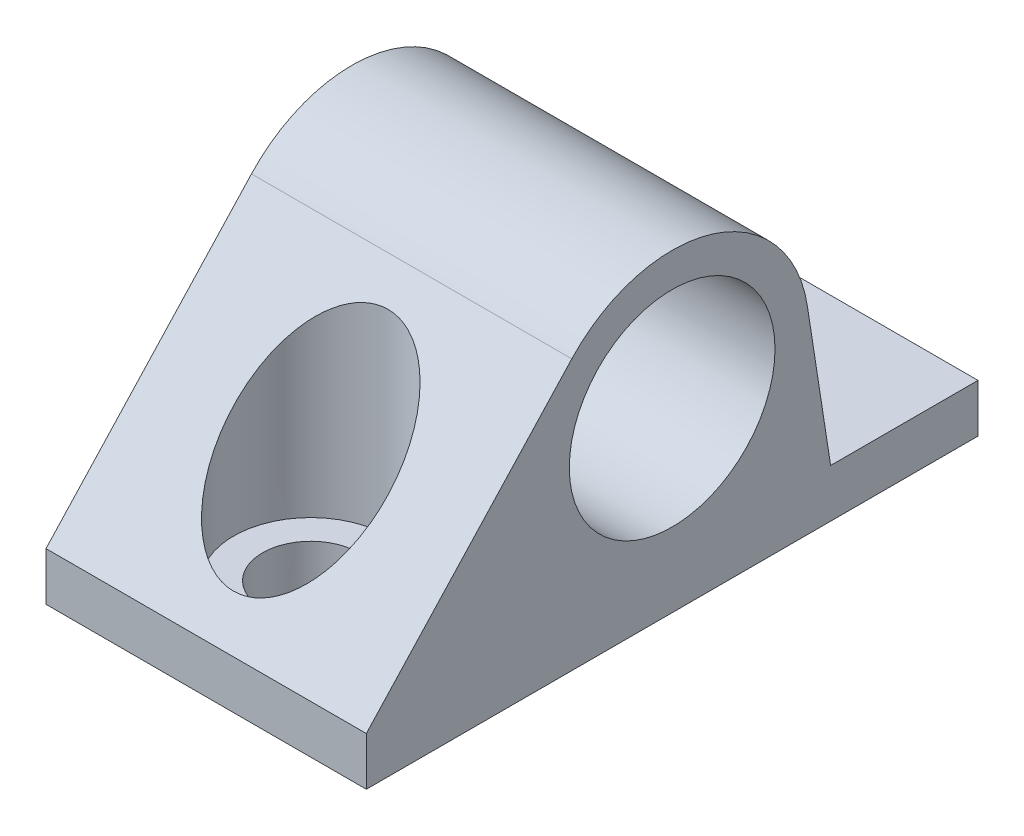
ISO-10303-21;
HEADER;
FILE_DESCRIPTION(('STEP AP214'),'2;1');
FILE_NAME('part.step','',(''),(''),'','','');
FILE_SCHEMA(('AUTOMOTIVE_DESIGN { 1 0 10303 214 1 1 1 1 }'));
ENDSEC;
DATA;
#1=APPLICATION_CONTEXT('core data for automotive mechanical design processes');
#2=APPLICATION_PROTOCOL_DEFINITION('international standard','automotive_design',2000,#1);
#3=PRODUCT_CONTEXT('',#1,'mechanical');
#4=PRODUCT('Part','Part','',(#3));
#5=PRODUCT_RELATED_PRODUCT_CATEGORY('part','',(#4));
#6=PRODUCT_DEFINITION_FORMATION('','',#4);
#7=PRODUCT_DEFINITION_CONTEXT('part definition',#1,'design');
#8=PRODUCT_DEFINITION('design','',#6,#7);
#9=PRODUCT_DEFINITION_SHAPE('','',#8);
#10=(LENGTH_UNIT() NAMED_UNIT(*) SI_UNIT(.MILLI.,.METRE.));
#11=(NAMED_UNIT(*) PLANE_ANGLE_UNIT() SI_UNIT($,.RADIAN.));
#12=(NAMED_UNIT(*) SI_UNIT($,.STERADIAN.) SOLID_ANGLE_UNIT());
#13=UNCERTAINTY_MEASURE_WITH_UNIT(LENGTH_MEASURE(1.E-05),#10,'distance_accuracy_value','');
#14=(GEOMETRIC_REPRESENTATION_CONTEXT(3) GLOBAL_UNCERTAINTY_ASSIGNED_CONTEXT((#13)) GLOBAL_UNIT_ASSIGNED_CONTEXT((#10,
#11,#12)) REPRESENTATION_CONTEXT('',''));
#15=CARTESIAN_POINT('',(0.,0.,0.));
#16=DIRECTION('',(0.,0.,1.));
#17=DIRECTION('',(1.,0.,0.));
#18=AXIS2_PLACEMENT_3D('',#15,#16,#17);
#19=CARTESIAN_POINT('',(121.506176910239,198.484265544604,-28.8439743525757));
#20=DIRECTION('',(0.,0.153427582169929,-0.988159894465207));
#21=DIRECTION('',(0.,0.988159894465207,0.153427582169929));
#22=AXIS2_PLACEMENT_3D('',#19,#20,#21);
#23=PLANE('',#22);
#24=CARTESIAN_POINT('',(111.556176910239,181.377967013817,-31.5));
#25=DIRECTION('',(0.,0.153427582169929,-0.988159894465207));
#26=DIRECTION('',(0.,-0.988159894465207,-0.153427582169929));
#27=AXIS2_PLACEMENT_3D('',#24,#25,#26);
#28=ELLIPSE('',#27,31.2851179176099,4.8);
#29=CARTESIAN_POINT('',(107.55798634947,198.484265544604,-28.8439743525757));
#30=VERTEX_POINT('',#29);
#31=CARTESIAN_POINT('',(109.06123317671,207.788399993048,-27.3993591029543));
#32=VERTEX_POINT('',#31);
#33=EDGE_CURVE('E60',#30,#32,#28,.T.);
#34=ORIENTED_EDGE('',*,*,#33,.F.);
#35=DIRECTION('',(-1.,0.,0.));
#36=VECTOR('',#35,1.);
#37=CARTESIAN_POINT('',(121.506176910239,198.484265544604,-28.8439743525757));
#38=LINE('',#37,#36);
#39=CARTESIAN_POINT('',(101.606176910238,198.484265544604,-28.8439743525757));
#40=VERTEX_POINT('',#39);
#41=EDGE_CURVE('E142',#30,#40,#38,.T.);
#42=ORIENTED_EDGE('',*,*,#41,.T.);
#43=DIRECTION('',(0.,-0.988159894465207,-0.153427582169929));
#44=VECTOR('',#43,1.);
#45=CARTESIAN_POINT('',(101.606176910238,198.484265544604,-28.8439743525757));
#46=LINE('',#45,#44);
#47=CARTESIAN_POINT('',(101.606176910238,207.788399993048,-27.3993591029543));
#48=VERTEX_POINT('',#47);
#49=EDGE_CURVE('E166',#48,#40,#46,.T.);
#50=ORIENTED_EDGE('',*,*,#49,.F.);
#51=DIRECTION('',(-1.,0.,0.));
#52=VECTOR('',#51,1.);
#53=CARTESIAN_POINT('',(121.506176910239,207.788399993048,-27.3993591029543));
#54=LINE('',#53,#52);
#55=EDGE_CURVE('E239',#32,#48,#54,.T.);
#56=ORIENTED_EDGE('',*,*,#55,.F.);
#57=EDGE_LOOP('',(#34,#42,#50,#56));
#58=FACE_BOUND('',#57,.T.);
#59=ADVANCED_FACE('F40',(#58),#23,.T.);
#60=CARTESIAN_POINT('',(101.606176910239,198.484265544604,-38.));
#61=DIRECTION('',(-1.,0.,0.));
#62=DIRECTION('',(0.,-1.,0.));
#63=AXIS2_PLACEMENT_3D('',#60,#61,#62);
#64=PLANE('',#63);
#65=DIRECTION('',(0.,-1.,0.));
#66=VECTOR('',#65,1.);
#67=CARTESIAN_POINT('',(101.606176910239,198.484265544604,0.));
#68=LINE('',#67,#66);
#69=CARTESIAN_POINT('',(101.606176910239,198.484265544604,0.));
#70=VERTEX_POINT('',#69);
#71=CARTESIAN_POINT('',(101.606176910239,195.484265544604,0.));
#72=VERTEX_POINT('',#71);
#73=EDGE_CURVE('E150',#70,#72,#68,.T.);
#74=ORIENTED_EDGE('',*,*,#73,.F.);
#75=DIRECTION('',(0.,0.733536752395156,-0.679649786938514));
#76=VECTOR('',#75,1.);
#77=CARTESIAN_POINT('',(101.606176910238,212.261288733581,-12.7649376046412));
#78=LINE('',#77,#76);
#79=CARTESIAN_POINT('',(101.606176910238,212.261288733581,-12.7649376046412));
#80=VERTEX_POINT('',#79);
#81=EDGE_CURVE('E212',#70,#80,#78,.T.);
#82=ORIENTED_EDGE('',*,*,#81,.T.);
#83=CARTESIAN_POINT('',(101.606176910238,206.484265544604,-19.));
#84=DIRECTION('',(-1.,0.,0.));
#85=DIRECTION('',(0.,0.,-1.));
#86=AXIS2_PLACEMENT_3D('',#83,#84,#85);
#87=CIRCLE('',#86,8.50000000000001);
#88=EDGE_CURVE('E171',#80,#48,#87,.T.);
#89=ORIENTED_EDGE('',*,*,#88,.T.);
#90=ORIENTED_EDGE('',*,*,#49,.T.);
#91=DIRECTION('',(0.,0.,1.));
#92=VECTOR('',#91,1.);
#93=CARTESIAN_POINT('',(101.606176910239,198.484265544604,-38.));
#94=LINE('',#93,#92);
#95=CARTESIAN_POINT('',(101.606176910239,198.484265544604,-38.));
#96=VERTEX_POINT('',#95);
#97=EDGE_CURVE('E50',#96,#40,#94,.T.);
#98=ORIENTED_EDGE('',*,*,#97,.F.);
#99=DIRECTION('',(0.,-1.,0.));
#100=VECTOR('',#99,1.);
#101=CARTESIAN_POINT('',(101.606176910239,198.484265544604,-38.));
#102=LINE('',#101,#100);
#103=CARTESIAN_POINT('',(101.606176910239,195.484265544604,-38.));
#104=VERTEX_POINT('',#103);
#105=EDGE_CURVE('E262',#96,#104,#102,.T.);
#106=ORIENTED_EDGE('',*,*,#105,.T.);
#107=DIRECTION('',(0.,0.,1.));
#108=VECTOR('',#107,1.);
#109=CARTESIAN_POINT('',(101.606176910239,195.484265544604,-38.));
#110=LINE('',#109,#108);
#111=EDGE_CURVE('E251',#104,#72,#110,.T.);
#112=ORIENTED_EDGE('',*,*,#111,.T.);
#113=EDGE_LOOP('',(#74,#82,#89,#90,#98,#106,#112));
#114=FACE_BOUND('',#113,.T.);
#115=CARTESIAN_POINT('',(101.606176910238,206.484265544604,-19.));
#116=DIRECTION('',(-1.,0.,0.));
#117=DIRECTION('',(0.,0.,1.));
#118=AXIS2_PLACEMENT_3D('',#115,#116,#117);
#119=CIRCLE('',#118,6.39);
#120=CARTESIAN_POINT('',(101.606176910238,206.484265544604,-12.61));
#121=VERTEX_POINT('',#120);
#122=EDGE_CURVE('E207',#121,#121,#119,.T.);
#123=ORIENTED_EDGE('',*,*,#122,.F.);
#124=EDGE_LOOP('',(#123));
#125=FACE_BOUND('',#124,.T.);
#126=ADVANCED_FACE('F42',(#114,#125),#64,.T.);
#127=CARTESIAN_POINT('',(121.506176910239,198.484265544604,-38.));
#128=DIRECTION('',(0.,1.,0.));
#129=DIRECTION('',(-1.,0.,0.));
#130=AXIS2_PLACEMENT_3D('',#127,#128,#129);
#131=PLANE('',#130);
#132=ORIENTED_EDGE('',*,*,#41,.F.);
#133=CARTESIAN_POINT('',(111.556176910239,198.484265544604,-31.5));
#134=DIRECTION('',(0.,-1.,0.));
#135=DIRECTION('',(1.,0.,0.));
#136=AXIS2_PLACEMENT_3D('',#133,#134,#135);
#137=CIRCLE('',#136,4.8);
#138=CARTESIAN_POINT('',(115.554367471008,198.484265544604,-28.8439743525757));
#139=VERTEX_POINT('',#138);
#140=EDGE_CURVE('E132',#139,#30,#137,.T.);
#141=ORIENTED_EDGE('',*,*,#140,.F.);
#142=CARTESIAN_POINT('',(121.506176910239,198.484265544604,-28.8439743525757));
#143=VERTEX_POINT('',#142);
#144=EDGE_CURVE('E70',#143,#139,#38,.T.);
#145=ORIENTED_EDGE('',*,*,#144,.F.);
#146=DIRECTION('',(0.,0.,1.));
#147=VECTOR('',#146,1.);
#148=CARTESIAN_POINT('',(121.506176910239,198.484265544604,-38.));
#149=LINE('',#148,#147);
#150=CARTESIAN_POINT('',(121.506176910239,198.484265544604,-38.));
#151=VERTEX_POINT('',#150);
#152=EDGE_CURVE('E244',#151,#143,#149,.T.);
#153=ORIENTED_EDGE('',*,*,#152,.F.);
#154=DIRECTION('',(-1.,0.,0.));
#155=VECTOR('',#154,1.);
#156=CARTESIAN_POINT('',(121.506176910239,198.484265544604,-38.));
#157=LINE('',#156,#155);
#158=EDGE_CURVE('E242',#151,#96,#157,.T.);
#159=ORIENTED_EDGE('',*,*,#158,.T.);
#160=ORIENTED_EDGE('',*,*,#97,.T.);
#161=EDGE_LOOP('',(#132,#141,#145,#153,#159,#160));
#162=FACE_BOUND('',#161,.T.);
#163=CARTESIAN_POINT('',(111.556176910239,198.484265544604,-31.5));
#164=DIRECTION('',(0.,-1.,0.));
#165=DIRECTION('',(1.,0.,0.));
#166=AXIS2_PLACEMENT_3D('',#163,#164,#165);
#167=CIRCLE('',#166,3.);
#168=CARTESIAN_POINT('',(114.556176910239,198.484265544604,-31.5));
#169=VERTEX_POINT('',#168);
#170=EDGE_CURVE('E136',#169,#169,#167,.T.);
#171=ORIENTED_EDGE('',*,*,#170,.T.);
#172=EDGE_LOOP('',(#171));
#173=FACE_BOUND('',#172,.T.);
#174=ADVANCED_FACE('F139',(#162,#173),#131,.T.);
#175=CARTESIAN_POINT('',(121.506176910239,195.484265544604,-38.));
#176=DIRECTION('',(1.,0.,0.));
#177=DIRECTION('',(0.,0.,-1.));
#178=AXIS2_PLACEMENT_3D('',#175,#176,#177);
#179=PLANE('',#178);
#180=DIRECTION('',(0.,1.,0.));
#181=VECTOR('',#180,1.);
#182=CARTESIAN_POINT('',(121.506176910239,195.484265544604,0.));
#183=LINE('',#182,#181);
#184=CARTESIAN_POINT('',(121.506176910239,195.484265544604,0.));
#185=VERTEX_POINT('',#184);
#186=CARTESIAN_POINT('',(121.506176910239,198.484265544604,0.));
#187=VERTEX_POINT('',#186);
#188=EDGE_CURVE('E263',#185,#187,#183,.T.);
#189=ORIENTED_EDGE('',*,*,#188,.F.);
#190=DIRECTION('',(0.,0.,1.));
#191=VECTOR('',#190,1.);
#192=CARTESIAN_POINT('',(121.506176910239,195.484265544604,-38.));
#193=LINE('',#192,#191);
#194=CARTESIAN_POINT('',(121.506176910239,195.484265544604,-38.));
#195=VERTEX_POINT('',#194);
#196=EDGE_CURVE('E247',#195,#185,#193,.T.);
#197=ORIENTED_EDGE('',*,*,#196,.F.);
#198=DIRECTION('',(0.,1.,0.));
#199=VECTOR('',#198,1.);
#200=CARTESIAN_POINT('',(121.506176910239,195.484265544604,-38.));
#201=LINE('',#200,#199);
#202=EDGE_CURVE('E270',#195,#151,#201,.T.);
#203=ORIENTED_EDGE('',*,*,#202,.T.);
#204=ORIENTED_EDGE('',*,*,#152,.T.);
#205=DIRECTION('',(0.,-0.988159894465207,-0.153427582169929));
#206=VECTOR('',#205,1.);
#207=CARTESIAN_POINT('',(121.506176910239,198.484265544604,-28.8439743525757));
#208=LINE('',#207,#206);
#209=CARTESIAN_POINT('',(121.506176910239,207.788399993048,-27.3993591029543));
#210=VERTEX_POINT('',#209);
#211=EDGE_CURVE('E148',#210,#143,#208,.T.);
#212=ORIENTED_EDGE('',*,*,#211,.F.);
#213=CARTESIAN_POINT('',(121.506176910239,206.484265544604,-19.));
#214=DIRECTION('',(-1.,0.,0.));
#215=DIRECTION('',(0.,0.,-1.));
#216=AXIS2_PLACEMENT_3D('',#213,#214,#215);
#217=CIRCLE('',#216,8.50000000000001);
#218=CARTESIAN_POINT('',(121.506176910239,212.261288733581,-12.7649376046412));
#219=VERTEX_POINT('',#218);
#220=EDGE_CURVE('E220',#219,#210,#217,.T.);
#221=ORIENTED_EDGE('',*,*,#220,.F.);
#222=DIRECTION('',(0.,0.733536752395156,-0.679649786938514));
#223=VECTOR('',#222,1.);
#224=CARTESIAN_POINT('',(121.506176910239,212.261288733581,-12.7649376046412));
#225=LINE('',#224,#223);
#226=EDGE_CURVE('E216',#187,#219,#225,.T.);
#227=ORIENTED_EDGE('',*,*,#226,.F.);
#228=EDGE_LOOP('',(#189,#197,#203,#204,#212,#221,#227));
#229=FACE_BOUND('',#228,.T.);
#230=CARTESIAN_POINT('',(121.506176910239,206.484265544604,-19.));
#231=DIRECTION('',(-1.,0.,0.));
#232=DIRECTION('',(0.,0.,1.));
#233=AXIS2_PLACEMENT_3D('',#230,#231,#232);
#234=CIRCLE('',#233,6.39);
#235=CARTESIAN_POINT('',(121.506176910239,206.484265544604,-12.61));
#236=VERTEX_POINT('',#235);
#237=EDGE_CURVE('E208',#236,#236,#234,.T.);
#238=ORIENTED_EDGE('',*,*,#237,.T.);
#239=EDGE_LOOP('',(#238));
#240=FACE_BOUND('',#239,.T.);
#241=ADVANCED_FACE('F288',(#229,#240),#179,.T.);
#242=CARTESIAN_POINT('',(114.604851947764,195.484265544604,-38.));
#243=DIRECTION('',(0.,-1.,0.));
#244=DIRECTION('',(0.,0.,-1.));
#245=AXIS2_PLACEMENT_3D('',#242,#243,#244);
#246=PLANE('',#245);
#247=CARTESIAN_POINT('',(111.556176910239,195.484265544604,-6.5));
#248=DIRECTION('',(0.,-1.,0.));
#249=DIRECTION('',(0.,0.,-1.));
#250=AXIS2_PLACEMENT_3D('',#247,#248,#249);
#251=CIRCLE('',#250,3.);
#252=CARTESIAN_POINT('',(111.556176910239,195.484265544604,-9.5));
#253=VERTEX_POINT('',#252);
#254=EDGE_CURVE('E44',#253,#253,#251,.T.);
#255=ORIENTED_EDGE('',*,*,#254,.F.);
#256=EDGE_LOOP('',(#255));
#257=FACE_BOUND('',#256,.T.);
#258=CARTESIAN_POINT('',(111.556176910239,195.484265544604,-31.5));
#259=DIRECTION('',(0.,-1.,0.));
#260=DIRECTION('',(0.,0.,-1.));
#261=AXIS2_PLACEMENT_3D('',#258,#259,#260);
#262=CIRCLE('',#261,3.);
#263=CARTESIAN_POINT('',(111.556176910239,195.484265544604,-34.5));
#264=VERTEX_POINT('',#263);
#265=EDGE_CURVE('E203',#264,#264,#262,.T.);
#266=ORIENTED_EDGE('',*,*,#265,.F.);
#267=EDGE_LOOP('',(#266));
#268=FACE_BOUND('',#267,.T.);
#269=DIRECTION('',(1.,0.,0.));
#270=VECTOR('',#269,1.);
#271=CARTESIAN_POINT('',(114.604851947764,195.484265544604,0.));
#272=LINE('',#271,#270);
#273=EDGE_CURVE('E156',#72,#185,#272,.T.);
#274=ORIENTED_EDGE('',*,*,#273,.F.);
#275=ORIENTED_EDGE('',*,*,#111,.F.);
#276=DIRECTION('',(1.,0.,0.));
#277=VECTOR('',#276,1.);
#278=CARTESIAN_POINT('',(101.606176910239,195.484265544604,-38.));
#279=LINE('',#278,#277);
#280=EDGE_CURVE('E272',#104,#195,#279,.T.);
#281=ORIENTED_EDGE('',*,*,#280,.T.);
#282=ORIENTED_EDGE('',*,*,#196,.T.);
#283=EDGE_LOOP('',(#274,#275,#281,#282));
#284=FACE_BOUND('',#283,.T.);
#285=ADVANCED_FACE('F292',(#257,#268,#284),#246,.T.);
#286=CARTESIAN_POINT('',(101.606176910239,195.484265544604,-38.));
#287=DIRECTION('',(0.,0.,1.));
#288=DIRECTION('',(1.,0.,0.));
#289=AXIS2_PLACEMENT_3D('',#286,#287,#288);
#290=PLANE('',#289);
#291=ORIENTED_EDGE('',*,*,#105,.F.);
#292=ORIENTED_EDGE('',*,*,#158,.F.);
#293=ORIENTED_EDGE('',*,*,#202,.F.);
#294=ORIENTED_EDGE('',*,*,#280,.F.);
#295=EDGE_LOOP('',(#291,#292,#293,#294));
#296=FACE_BOUND('',#295,.T.);
#297=ADVANCED_FACE('F318',(#296),#290,.F.);
#298=CARTESIAN_POINT('',(101.606176910239,195.484265544604,0.));
#299=DIRECTION('',(0.,0.,1.));
#300=DIRECTION('',(1.,0.,0.));
#301=AXIS2_PLACEMENT_3D('',#298,#299,#300);
#302=PLANE('',#301);
#303=ORIENTED_EDGE('',*,*,#73,.T.);
#304=ORIENTED_EDGE('',*,*,#273,.T.);
#305=ORIENTED_EDGE('',*,*,#188,.T.);
#306=DIRECTION('',(-1.,0.,0.));
#307=VECTOR('',#306,1.);
#308=CARTESIAN_POINT('',(121.506176910239,198.484265544604,0.));
#309=LINE('',#308,#307);
#310=EDGE_CURVE('E258',#187,#70,#309,.T.);
#311=ORIENTED_EDGE('',*,*,#310,.T.);
#312=EDGE_LOOP('',(#303,#304,#305,#311));
#313=FACE_BOUND('',#312,.T.);
#314=ADVANCED_FACE('F313',(#313),#302,.T.);
#315=CARTESIAN_POINT('',(114.051120643768,207.788399993048,-27.3993591029543));
#316=VERTEX_POINT('',#315);
#317=EDGE_CURVE('E130',#316,#139,#28,.T.);
#318=ORIENTED_EDGE('',*,*,#317,.F.);
#319=EDGE_CURVE('E159',#210,#316,#54,.T.);
#320=ORIENTED_EDGE('',*,*,#319,.F.);
#321=ORIENTED_EDGE('',*,*,#211,.T.);
#322=ORIENTED_EDGE('',*,*,#144,.T.);
#323=EDGE_LOOP('',(#318,#320,#321,#322));
#324=FACE_BOUND('',#323,.T.);
#325=ADVANCED_FACE('F146',(#324),#23,.T.);
#326=CARTESIAN_POINT('',(121.506176910239,206.484265544604,-19.));
#327=DIRECTION('',(-1.,0.,0.));
#328=DIRECTION('',(0.,0.,1.));
#329=AXIS2_PLACEMENT_3D('',#326,#327,#328);
#330=CYLINDRICAL_SURFACE('',#329,8.50000000000001);
#331=CARTESIAN_POINT('',(109.06123317671,207.788399993048,-27.3993591029543));
#332=CARTESIAN_POINT('',(109.083193015294,207.874421012583,-27.3860115335064));
#333=CARTESIAN_POINT('',(109.107557298254,207.959651399128,-27.3714163239943));
#334=CARTESIAN_POINT('',(109.16136935961,208.128136338159,-27.3399641669434));
#335=CARTESIAN_POINT('',(109.190821014112,208.211389328631,-27.3231054970547));
#336=CARTESIAN_POINT('',(109.255407475636,208.376305657393,-27.2871820861855));
#337=CARTESIAN_POINT('',(109.29060195803,208.457940941595,-27.2680948544479));
#338=CARTESIAN_POINT('',(109.366690788354,208.618040646279,-27.2282335368457));
#339=CARTESIAN_POINT('',(109.407583940506,208.696505727535,-27.2074598052481));
#340=CARTESIAN_POINT('',(109.539706551842,208.927037397824,-27.1429883933013));
#341=CARTESIAN_POINT('',(109.640101035473,209.073505775026,-27.0973049311087));
#342=CARTESIAN_POINT('',(109.866330282898,209.344308379211,-27.0056548697802));
#343=CARTESIAN_POINT('',(109.992033843542,209.468750780615,-26.9596908702983));
#344=CARTESIAN_POINT('',(110.228262334397,209.656805154762,-26.8861967176631));
#345=CARTESIAN_POINT('',(110.332618457399,209.727592554042,-26.857186170495));
#346=CARTESIAN_POINT('',(110.55259041559,209.851869511144,-26.8047291552218));
#347=CARTESIAN_POINT('',(110.668206840348,209.905358162603,-26.7812829786776));
#348=CARTESIAN_POINT('',(110.908719771315,209.992700013686,-26.7423008475878));
#349=CARTESIAN_POINT('',(111.033664685331,210.026441412436,-26.7268099921778));
#350=CARTESIAN_POINT('',(111.288305026767,210.071963417236,-26.7057821561769));
#351=CARTESIAN_POINT('',(111.417997922058,210.083755559896,-26.7002399465959));
#352=CARTESIAN_POINT('',(111.664777865209,210.084695428697,-26.6997976504364));
#353=CARTESIAN_POINT('',(111.781861140767,210.075938805136,-26.7039126806826));
#354=CARTESIAN_POINT('',(112.012650476068,210.040458028587,-26.7203544104774));
#355=CARTESIAN_POINT('',(112.126356887745,210.013735754867,-26.732680251146));
#356=CARTESIAN_POINT('',(112.346355359624,209.943853382876,-26.7641925982301));
#357=CARTESIAN_POINT('',(112.452706283241,209.900847651729,-26.7833145759541));
#358=CARTESIAN_POINT('',(112.656979005441,209.800106315568,-26.8267617279849));
#359=CARTESIAN_POINT('',(112.754899339331,209.742368157886,-26.8510878038809));
#360=CARTESIAN_POINT('',(112.950351775601,209.607675056536,-26.9056995090589));
#361=CARTESIAN_POINT('',(113.04684972534,209.529369685241,-26.9363386973124));
#362=CARTESIAN_POINT('',(113.227278092316,209.360003205568,-26.9992702465522));
#363=CARTESIAN_POINT('',(113.311197545759,209.268931101579,-27.0315640172057));
#364=CARTESIAN_POINT('',(113.504730994976,209.029124255624,-27.1115016666582));
#365=CARTESIAN_POINT('',(113.606651937457,208.874076513706,-27.1588746056065));
#366=CARTESIAN_POINT('',(113.784436443544,208.548077168189,-27.2473817014562));
#367=CARTESIAN_POINT('',(113.860263729009,208.377103839173,-27.288507128426));
#368=CARTESIAN_POINT('',(113.948829621864,208.133512001484,-27.3387523108764));
#369=CARTESIAN_POINT('',(113.971650174751,208.065211766016,-27.3519776179488));
#370=CARTESIAN_POINT('',(114.013872101353,207.927587594443,-27.3768538294501));
#371=CARTESIAN_POINT('',(114.033286806615,207.858268855632,-27.3885108289415));
#372=CARTESIAN_POINT('',(114.051120643768,207.788399993048,-27.3993591029543));
#373=B_SPLINE_CURVE_WITH_KNOTS('',3,(#331,#332,#333,#334,#335,#336,#337,#338,#339,#340,#341,
#342,#343,#344,#345,#346,#347,#348,#349,#350,#351,#352,#353,#354,#355,#356,#357,#358,#359,#360,
#361,#362,#363,#364,#365,#366,#367,#368,#369,#370,#371,#372),.UNSPECIFIED.,.F.,.F.,(4,2,2,2,2,2,
2,2,2,2,2,2,2,2,2,2,2,2,2,2,4),(0.,0.269310690095278,0.538827482455318,0.811347763715165,
1.08381094661095,1.631119773412,2.17566118553392,2.56229558163826,2.94895023206587,
3.33777330025686,3.72639194385354,4.07712182181862,4.42781501795416,4.77526366366238,
5.12277255227642,5.50531181536021,5.8881825959648,6.45956633082167,7.03174128383051,
7.25131390458313,7.47000688068161),.UNSPECIFIED.);
#374=EDGE_CURVE('E11',#32,#316,#373,.T.);
#375=ORIENTED_EDGE('',*,*,#374,.F.);
#376=ORIENTED_EDGE('',*,*,#55,.T.);
#377=ORIENTED_EDGE('',*,*,#88,.F.);
#378=DIRECTION('',(-1.,0.,0.));
#379=VECTOR('',#378,1.);
#380=CARTESIAN_POINT('',(121.506176910239,212.261288733581,-12.7649376046412));
#381=LINE('',#380,#379);
#382=EDGE_CURVE('E275',#219,#80,#381,.T.);
#383=ORIENTED_EDGE('',*,*,#382,.F.);
#384=ORIENTED_EDGE('',*,*,#220,.T.);
#385=ORIENTED_EDGE('',*,*,#319,.T.);
#386=EDGE_LOOP('',(#375,#376,#377,#383,#384,#385));
#387=FACE_BOUND('',#386,.T.);
#388=ADVANCED_FACE('F284',(#387),#330,.T.);
#389=CARTESIAN_POINT('',(121.506176910239,212.261288733581,-12.7649376046412));
#390=DIRECTION('',(0.,0.679649786938515,0.733536752395156));
#391=DIRECTION('',(0.,-0.733536752395156,0.679649786938515));
#392=AXIS2_PLACEMENT_3D('',#389,#390,#391);
#393=PLANE('',#392);
#394=CARTESIAN_POINT('',(111.556176910239,205.499626958967,-6.5));
#395=DIRECTION('',(0.,0.679649786938515,0.733536752395156));
#396=DIRECTION('',(0.,-0.733536752395156,0.679649786938515));
#397=AXIS2_PLACEMENT_3D('',#394,#395,#396);
#398=ELLIPSE('',#397,7.06246083239667,4.8);
#399=CARTESIAN_POINT('',(111.556176910239,200.319052376053,-1.7));
#400=VERTEX_POINT('',#399);
#401=EDGE_CURVE('E181',#400,#400,#398,.T.);
#402=ORIENTED_EDGE('',*,*,#401,.F.);
#403=EDGE_LOOP('',(#402));
#404=FACE_BOUND('',#403,.T.);
#405=ORIENTED_EDGE('',*,*,#81,.F.);
#406=ORIENTED_EDGE('',*,*,#310,.F.);
#407=ORIENTED_EDGE('',*,*,#226,.T.);
#408=ORIENTED_EDGE('',*,*,#382,.T.);
#409=EDGE_LOOP('',(#405,#406,#407,#408));
#410=FACE_BOUND('',#409,.T.);
#411=ADVANCED_FACE('F300',(#404,#410),#393,.T.);
#412=CARTESIAN_POINT('',(121.506176910239,206.484265544604,-19.));
#413=DIRECTION('',(-1.,0.,0.));
#414=DIRECTION('',(0.,0.,1.));
#415=AXIS2_PLACEMENT_3D('',#412,#413,#414);
#416=CYLINDRICAL_SURFACE('',#415,6.39);
#417=ORIENTED_EDGE('',*,*,#237,.F.);
#418=EDGE_LOOP('',(#417));
#419=FACE_BOUND('',#418,.T.);
#420=ORIENTED_EDGE('',*,*,#122,.T.);
#421=EDGE_LOOP('',(#420));
#422=FACE_BOUND('',#421,.T.);
#423=ADVANCED_FACE('F296',(#419,#422),#416,.F.);
#424=CARTESIAN_POINT('',(111.556176910239,189.90606828779,-31.5));
#425=DIRECTION('',(0.,-1.,0.));
#426=DIRECTION('',(1.,0.,0.));
#427=AXIS2_PLACEMENT_3D('',#424,#425,#426);
#428=CYLINDRICAL_SURFACE('',#427,3.);
#429=ORIENTED_EDGE('',*,*,#265,.T.);
#430=EDGE_LOOP('',(#429));
#431=FACE_BOUND('',#430,.T.);
#432=ORIENTED_EDGE('',*,*,#170,.F.);
#433=EDGE_LOOP('',(#432));
#434=FACE_BOUND('',#433,.T.);
#435=ADVANCED_FACE('F299',(#431,#434),#428,.F.);
#436=CARTESIAN_POINT('',(111.556176910239,189.90606828779,-31.5));
#437=DIRECTION('',(0.,-1.,0.));
#438=DIRECTION('',(1.,0.,0.));
#439=AXIS2_PLACEMENT_3D('',#436,#437,#438);
#440=CYLINDRICAL_SURFACE('',#439,4.8);
#441=ORIENTED_EDGE('',*,*,#33,.T.);
#442=ORIENTED_EDGE('',*,*,#374,.T.);
#443=ORIENTED_EDGE('',*,*,#317,.T.);
#444=ORIENTED_EDGE('',*,*,#140,.T.);
#445=EDGE_LOOP('',(#441,#442,#443,#444));
#446=FACE_BOUND('',#445,.T.);
#447=ADVANCED_FACE('F131',(#446),#440,.F.);
#448=CARTESIAN_POINT('',(111.556176910239,189.90606828779,-6.5));
#449=DIRECTION('',(0.,-1.,0.));
#450=DIRECTION('',(1.,0.,0.));
#451=AXIS2_PLACEMENT_3D('',#448,#449,#450);
#452=CYLINDRICAL_SURFACE('',#451,3.);
#453=ORIENTED_EDGE('',*,*,#254,.T.);
#454=EDGE_LOOP('',(#453));
#455=FACE_BOUND('',#454,.T.);
#456=CARTESIAN_POINT('',(111.556176910239,198.484265544604,-6.5));
#457=DIRECTION('',(0.,1.,0.));
#458=DIRECTION('',(1.,0.,0.));
#459=AXIS2_PLACEMENT_3D('',#456,#457,#458);
#460=CIRCLE('',#459,3.);
#461=CARTESIAN_POINT('',(114.556176910239,198.484265544604,-6.5));
#462=VERTEX_POINT('',#461);
#463=EDGE_CURVE('E184',#462,#462,#460,.T.);
#464=ORIENTED_EDGE('',*,*,#463,.T.);
#465=EDGE_LOOP('',(#464));
#466=FACE_BOUND('',#465,.T.);
#467=ADVANCED_FACE('F363',(#455,#466),#452,.F.);
#468=CARTESIAN_POINT('',(111.556176910239,198.484265544604,-11.3));
#469=DIRECTION('',(0.,-1.,0.));
#470=DIRECTION('',(1.,0.,0.));
#471=AXIS2_PLACEMENT_3D('',#468,#469,#470);
#472=PLANE('',#471);
#473=CARTESIAN_POINT('',(111.556176910239,198.484265544604,-6.5));
#474=DIRECTION('',(0.,1.,0.));
#475=DIRECTION('',(1.,0.,0.));
#476=AXIS2_PLACEMENT_3D('',#473,#474,#475);
#477=CIRCLE('',#476,4.8);
#478=CARTESIAN_POINT('',(116.356176910239,198.484265544604,-6.5));
#479=VERTEX_POINT('',#478);
#480=EDGE_CURVE('E192',#479,#479,#477,.T.);
#481=ORIENTED_EDGE('',*,*,#480,.T.);
#482=EDGE_LOOP('',(#481));
#483=FACE_BOUND('',#482,.T.);
#484=ORIENTED_EDGE('',*,*,#463,.F.);
#485=EDGE_LOOP('',(#484));
#486=FACE_BOUND('',#485,.T.);
#487=ADVANCED_FACE('F370',(#483,#486),#472,.F.);
#488=CARTESIAN_POINT('',(111.556176910239,189.90606828779,-6.5));
#489=DIRECTION('',(0.,-1.,0.));
#490=DIRECTION('',(1.,0.,0.));
#491=AXIS2_PLACEMENT_3D('',#488,#489,#490);
#492=CYLINDRICAL_SURFACE('',#491,4.8);
#493=ORIENTED_EDGE('',*,*,#401,.T.);
#494=EDGE_LOOP('',(#493));
#495=FACE_BOUND('',#494,.T.);
#496=ORIENTED_EDGE('',*,*,#480,.F.);
#497=EDGE_LOOP('',(#496));
#498=FACE_BOUND('',#497,.T.);
#499=ADVANCED_FACE('F377',(#495,#498),#492,.F.);
#500=CLOSED_SHELL('',(#59,#126,#174,#241,#285,#297,#314,#325,#388,#411,#423,#435,#447,#467,#487,#499));
#501=MANIFOLD_SOLID_BREP('B2',#500);
#502=ADVANCED_BREP_SHAPE_REPRESENTATION('',(#18,#501),#14);
#503=SHAPE_DEFINITION_REPRESENTATION(#9,#502);
ENDSEC;
END-ISO-10303-21;
